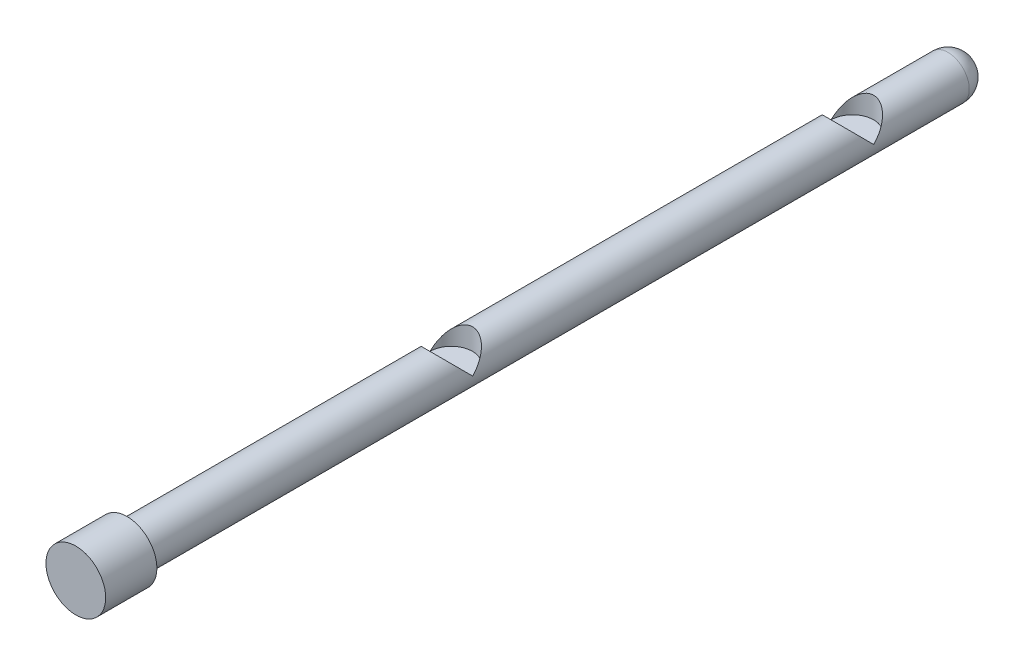
ISO-10303-21;
HEADER;
FILE_DESCRIPTION(('STEP AP214'),'2;1');
FILE_NAME('part.step','',(''),(''),'','','');
FILE_SCHEMA(('AUTOMOTIVE_DESIGN { 1 0 10303 214 1 1 1 1 }'));
ENDSEC;
DATA;
#1=APPLICATION_CONTEXT('core data for automotive mechanical design processes');
#2=APPLICATION_PROTOCOL_DEFINITION('international standard','automotive_design',2000,#1);
#3=PRODUCT_CONTEXT('',#1,'mechanical');
#4=PRODUCT('Part','Part','',(#3));
#5=PRODUCT_RELATED_PRODUCT_CATEGORY('part','',(#4));
#6=PRODUCT_DEFINITION_FORMATION('','',#4);
#7=PRODUCT_DEFINITION_CONTEXT('part definition',#1,'design');
#8=PRODUCT_DEFINITION('design','',#6,#7);
#9=PRODUCT_DEFINITION_SHAPE('','',#8);
#10=(LENGTH_UNIT() NAMED_UNIT(*) SI_UNIT(.MILLI.,.METRE.));
#11=(NAMED_UNIT(*) PLANE_ANGLE_UNIT() SI_UNIT($,.RADIAN.));
#12=(NAMED_UNIT(*) SI_UNIT($,.STERADIAN.) SOLID_ANGLE_UNIT());
#13=UNCERTAINTY_MEASURE_WITH_UNIT(LENGTH_MEASURE(1.E-05),#10,'distance_accuracy_value','');
#14=(GEOMETRIC_REPRESENTATION_CONTEXT(3) GLOBAL_UNCERTAINTY_ASSIGNED_CONTEXT((#13)) GLOBAL_UNIT_ASSIGNED_CONTEXT((#10,
#11,#12)) REPRESENTATION_CONTEXT('',''));
#15=CARTESIAN_POINT('',(0.,0.,0.));
#16=DIRECTION('',(0.,0.,1.));
#17=DIRECTION('',(1.,0.,0.));
#18=AXIS2_PLACEMENT_3D('',#15,#16,#17);
#19=CARTESIAN_POINT('',(0.,0.,455.));
#20=DIRECTION('',(0.,0.,-1.));
#21=DIRECTION('',(-1.,0.,0.));
#22=AXIS2_PLACEMENT_3D('',#19,#20,#21);
#23=CYLINDRICAL_SURFACE('',#22,17.5);
#24=CARTESIAN_POINT('',(0.,0.,455.));
#25=DIRECTION('',(0.,0.,1.));
#26=DIRECTION('',(1.,0.,0.));
#27=AXIS2_PLACEMENT_3D('',#24,#25,#26);
#28=CIRCLE('',#27,17.5);
#29=CARTESIAN_POINT('',(17.5,0.,455.));
#30=VERTEX_POINT('',#29);
#31=EDGE_CURVE('E11',#30,#30,#28,.T.);
#32=ORIENTED_EDGE('',*,*,#31,.F.);
#33=EDGE_LOOP('',(#32));
#34=FACE_BOUND('',#33,.T.);
#35=CARTESIAN_POINT('',(0.,0.,425.));
#36=DIRECTION('',(0.,0.,1.));
#37=DIRECTION('',(1.,0.,0.));
#38=AXIS2_PLACEMENT_3D('',#35,#36,#37);
#39=CIRCLE('',#38,17.5);
#40=CARTESIAN_POINT('',(17.5,0.,425.));
#41=VERTEX_POINT('',#40);
#42=EDGE_CURVE('E47',#41,#41,#39,.T.);
#43=ORIENTED_EDGE('',*,*,#42,.T.);
#44=EDGE_LOOP('',(#43));
#45=FACE_BOUND('',#44,.T.);
#46=ADVANCED_FACE('F44',(#34,#45),#23,.T.);
#47=CARTESIAN_POINT('',(0.,0.,455.));
#48=DIRECTION('',(0.,0.,1.));
#49=DIRECTION('',(1.,0.,0.));
#50=AXIS2_PLACEMENT_3D('',#47,#48,#49);
#51=PLANE('',#50);
#52=ORIENTED_EDGE('',*,*,#31,.T.);
#53=EDGE_LOOP('',(#52));
#54=FACE_BOUND('',#53,.T.);
#55=ADVANCED_FACE('F59',(#54),#51,.T.);
#56=CARTESIAN_POINT('',(0.,0.,425.));
#57=DIRECTION('',(0.,0.,1.));
#58=DIRECTION('',(1.,0.,0.));
#59=AXIS2_PLACEMENT_3D('',#56,#57,#58);
#60=PLANE('',#59);
#61=ORIENTED_EDGE('',*,*,#42,.F.);
#62=EDGE_LOOP('',(#61));
#63=FACE_BOUND('',#62,.T.);
#64=ADVANCED_FACE('F57',(#63),#60,.F.);
#65=CLOSED_SHELL('',(#46,#55,#64));
#66=MANIFOLD_SOLID_BREP('B2',#65);
#67=CARTESIAN_POINT('',(0.,0.,425.));
#68=DIRECTION('',(0.,0.,-1.));
#69=DIRECTION('',(-1.,0.,0.));
#70=AXIS2_PLACEMENT_3D('',#67,#68,#69);
#71=CYLINDRICAL_SURFACE('',#70,12.5);
#72=CARTESIAN_POINT('',(0.,0.,235.));
#73=DIRECTION('',(0.,-0.707106781186547,-0.707106781186547));
#74=DIRECTION('',(0.,0.707106781186547,-0.707106781186547));
#75=AXIS2_PLACEMENT_3D('',#72,#73,#74);
#76=ELLIPSE('',#75,17.6776695296637,12.5);
#77=CARTESIAN_POINT('',(12.5,0.,235.));
#78=VERTEX_POINT('',#77);
#79=CARTESIAN_POINT('',(-12.5,0.,235.));
#80=VERTEX_POINT('',#79);
#81=EDGE_CURVE('E117',#78,#80,#76,.F.);
#82=ORIENTED_EDGE('',*,*,#81,.F.);
#83=CARTESIAN_POINT('',(0.,0.,235.));
#84=DIRECTION('',(0.,0.707106781186547,-0.707106781186547));
#85=DIRECTION('',(0.,-0.707106781186547,-0.707106781186547));
#86=AXIS2_PLACEMENT_3D('',#83,#84,#85);
#87=ELLIPSE('',#86,17.6776695296637,12.5);
#88=EDGE_CURVE('E137',#80,#78,#87,.T.);
#89=ORIENTED_EDGE('',*,*,#88,.F.);
#90=EDGE_LOOP('',(#82,#89));
#91=FACE_BOUND('',#90,.T.);
#92=CARTESIAN_POINT('',(0.,0.,425.));
#93=DIRECTION('',(0.,0.,1.));
#94=DIRECTION('',(1.,0.,0.));
#95=AXIS2_PLACEMENT_3D('',#92,#93,#94);
#96=CIRCLE('',#95,12.5);
#97=CARTESIAN_POINT('',(12.5,0.,425.));
#98=VERTEX_POINT('',#97);
#99=EDGE_CURVE('E134',#98,#98,#96,.T.);
#100=ORIENTED_EDGE('',*,*,#99,.F.);
#101=EDGE_LOOP('',(#100));
#102=FACE_BOUND('',#101,.T.);
#103=CARTESIAN_POINT('',(0.,0.,0.));
#104=DIRECTION('',(0.,-0.707106781186547,-0.707106781186547));
#105=DIRECTION('',(0.,0.707106781186547,-0.707106781186547));
#106=AXIS2_PLACEMENT_3D('',#103,#104,#105);
#107=ELLIPSE('',#106,17.6776695296637,12.5);
#108=CARTESIAN_POINT('',(12.5,0.,0.));
#109=VERTEX_POINT('',#108);
#110=CARTESIAN_POINT('',(-12.5,0.,0.));
#111=VERTEX_POINT('',#110);
#112=EDGE_CURVE('E42',#109,#111,#107,.F.);
#113=ORIENTED_EDGE('',*,*,#112,.F.);
#114=CARTESIAN_POINT('',(0.,0.,0.));
#115=DIRECTION('',(0.,0.707106781186547,-0.707106781186547));
#116=DIRECTION('',(0.,-0.707106781186547,-0.707106781186547));
#117=AXIS2_PLACEMENT_3D('',#114,#115,#116);
#118=ELLIPSE('',#117,17.6776695296637,12.5);
#119=EDGE_CURVE('E91',#111,#109,#118,.T.);
#120=ORIENTED_EDGE('',*,*,#119,.F.);
#121=EDGE_LOOP('',(#113,#120));
#122=FACE_BOUND('',#121,.T.);
#123=CARTESIAN_POINT('',(0.,0.,-56.));
#124=DIRECTION('',(0.,0.,-1.));
#125=DIRECTION('',(-1.,0.,0.));
#126=AXIS2_PLACEMENT_3D('',#123,#124,#125);
#127=CIRCLE('',#126,12.5);
#128=CARTESIAN_POINT('',(-12.5,0.,-56.));
#129=VERTEX_POINT('',#128);
#130=EDGE_CURVE('E119',#129,#129,#127,.T.);
#131=ORIENTED_EDGE('',*,*,#130,.F.);
#132=EDGE_LOOP('',(#131));
#133=FACE_BOUND('',#132,.T.);
#134=ADVANCED_FACE('F84',(#91,#102,#122,#133),#71,.T.);
#135=CARTESIAN_POINT('',(0.,0.,425.));
#136=DIRECTION('',(0.,0.,1.));
#137=DIRECTION('',(1.,0.,0.));
#138=AXIS2_PLACEMENT_3D('',#135,#136,#137);
#139=PLANE('',#138);
#140=ORIENTED_EDGE('',*,*,#99,.T.);
#141=EDGE_LOOP('',(#140));
#142=FACE_BOUND('',#141,.T.);
#143=ADVANCED_FACE('F126',(#142),#139,.T.);
#144=CARTESIAN_POINT('',(0.,20.,235.));
#145=DIRECTION('',(0.,-1.,0.));
#146=DIRECTION('',(0.,0.,-1.));
#147=AXIS2_PLACEMENT_3D('',#144,#145,#146);
#148=CYLINDRICAL_SURFACE('',#147,12.5);
#149=ORIENTED_EDGE('',*,*,#81,.T.);
#150=CARTESIAN_POINT('',(0.,0.,235.));
#151=DIRECTION('',(0.,1.,0.));
#152=DIRECTION('',(0.,0.,1.));
#153=AXIS2_PLACEMENT_3D('',#150,#151,#152);
#154=CIRCLE('',#153,12.5);
#155=EDGE_CURVE('E104',#78,#80,#154,.T.);
#156=ORIENTED_EDGE('',*,*,#155,.F.);
#157=EDGE_LOOP('',(#149,#156));
#158=FACE_BOUND('',#157,.T.);
#159=ADVANCED_FACE('F143',(#158),#148,.F.);
#160=ORIENTED_EDGE('',*,*,#88,.T.);
#161=EDGE_CURVE('E123',#80,#78,#154,.T.);
#162=ORIENTED_EDGE('',*,*,#161,.F.);
#163=EDGE_LOOP('',(#160,#162));
#164=FACE_BOUND('',#163,.T.);
#165=ADVANCED_FACE('F146',(#164),#148,.F.);
#166=CARTESIAN_POINT('',(0.,0.,235.));
#167=DIRECTION('',(0.,1.,0.));
#168=DIRECTION('',(0.,0.,1.));
#169=AXIS2_PLACEMENT_3D('',#166,#167,#168);
#170=PLANE('',#169);
#171=ORIENTED_EDGE('',*,*,#155,.T.);
#172=ORIENTED_EDGE('',*,*,#161,.T.);
#173=EDGE_LOOP('',(#171,#172));
#174=FACE_BOUND('',#173,.T.);
#175=ADVANCED_FACE('F147',(#174),#170,.T.);
#176=CARTESIAN_POINT('',(0.,212.5,0.));
#177=DIRECTION('',(0.,-1.,0.));
#178=DIRECTION('',(0.,0.,-1.));
#179=AXIS2_PLACEMENT_3D('',#176,#177,#178);
#180=CYLINDRICAL_SURFACE('',#179,12.5);
#181=ORIENTED_EDGE('',*,*,#112,.T.);
#182=CARTESIAN_POINT('',(0.,0.,0.));
#183=DIRECTION('',(0.,1.,0.));
#184=DIRECTION('',(0.,0.,1.));
#185=AXIS2_PLACEMENT_3D('',#182,#183,#184);
#186=CIRCLE('',#185,12.5);
#187=EDGE_CURVE('E97',#109,#111,#186,.T.);
#188=ORIENTED_EDGE('',*,*,#187,.F.);
#189=EDGE_LOOP('',(#181,#188));
#190=FACE_BOUND('',#189,.T.);
#191=ADVANCED_FACE('F122',(#190),#180,.F.);
#192=ORIENTED_EDGE('',*,*,#119,.T.);
#193=EDGE_CURVE('E114',#111,#109,#186,.T.);
#194=ORIENTED_EDGE('',*,*,#193,.F.);
#195=EDGE_LOOP('',(#192,#194));
#196=FACE_BOUND('',#195,.T.);
#197=ADVANCED_FACE('F113',(#196),#180,.F.);
#198=CARTESIAN_POINT('',(0.,0.,0.));
#199=DIRECTION('',(0.,1.,0.));
#200=DIRECTION('',(0.,0.,1.));
#201=AXIS2_PLACEMENT_3D('',#198,#199,#200);
#202=PLANE('',#201);
#203=ORIENTED_EDGE('',*,*,#187,.T.);
#204=ORIENTED_EDGE('',*,*,#193,.T.);
#205=EDGE_LOOP('',(#203,#204));
#206=FACE_BOUND('',#205,.T.);
#207=ADVANCED_FACE('F118',(#206),#202,.T.);
#208=CARTESIAN_POINT('',(0.,0.,-56.));
#209=DIRECTION('',(0.,1.,0.));
#210=DIRECTION('',(0.,0.,-1.));
#211=AXIS2_PLACEMENT_3D('',#208,#209,#210);
#212=SPHERICAL_SURFACE('',#211,12.5);
#213=CARTESIAN_POINT('',(0.,0.,-56.));
#214=DIRECTION('',(0.,0.,-1.));
#215=DIRECTION('',(-1.,0.,0.));
#216=AXIS2_PLACEMENT_3D('',#213,#214,#215);
#217=SPHERICAL_SURFACE('',#216,12.5);
#218=ORIENTED_EDGE('',*,*,#130,.T.);
#219=EDGE_LOOP('',(#218));
#220=FACE_BOUND('',#219,.T.);
#221=ADVANCED_FACE('F198',(#220),#217,.T.);
#222=CLOSED_SHELL('',(#134,#143,#159,#165,#175,#191,#197,#207,#221));
#223=MANIFOLD_SOLID_BREP('B6',#222);
#224=ADVANCED_BREP_SHAPE_REPRESENTATION('',(#18,#66,#223),#14);
#225=SHAPE_DEFINITION_REPRESENTATION(#9,#224);
ENDSEC;
END-ISO-10303-21;
